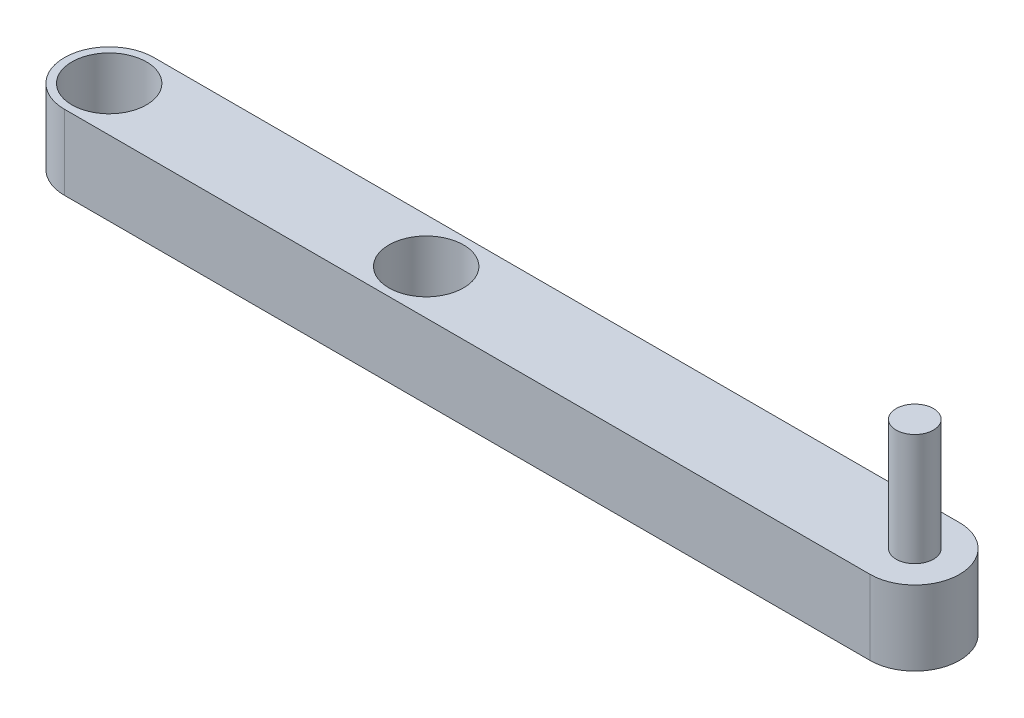
ISO-10303-21;
HEADER;
FILE_DESCRIPTION(('STEP AP214'),'2;1');
FILE_NAME('part.step','',(''),(''),'','','');
FILE_SCHEMA(('AUTOMOTIVE_DESIGN { 1 0 10303 214 1 1 1 1 }'));
ENDSEC;
DATA;
#1=APPLICATION_CONTEXT('core data for automotive mechanical design processes');
#2=APPLICATION_PROTOCOL_DEFINITION('international standard','automotive_design',2000,#1);
#3=PRODUCT_CONTEXT('',#1,'mechanical');
#4=PRODUCT('Part','Part','',(#3));
#5=PRODUCT_RELATED_PRODUCT_CATEGORY('part','',(#4));
#6=PRODUCT_DEFINITION_FORMATION('','',#4);
#7=PRODUCT_DEFINITION_CONTEXT('part definition',#1,'design');
#8=PRODUCT_DEFINITION('design','',#6,#7);
#9=PRODUCT_DEFINITION_SHAPE('','',#8);
#10=(LENGTH_UNIT() NAMED_UNIT(*) SI_UNIT(.MILLI.,.METRE.));
#11=(NAMED_UNIT(*) PLANE_ANGLE_UNIT() SI_UNIT($,.RADIAN.));
#12=(NAMED_UNIT(*) SI_UNIT($,.STERADIAN.) SOLID_ANGLE_UNIT());
#13=UNCERTAINTY_MEASURE_WITH_UNIT(LENGTH_MEASURE(1.E-05),#10,'distance_accuracy_value','');
#14=(GEOMETRIC_REPRESENTATION_CONTEXT(3) GLOBAL_UNCERTAINTY_ASSIGNED_CONTEXT((#13)) GLOBAL_UNIT_ASSIGNED_CONTEXT((#10,
#11,#12)) REPRESENTATION_CONTEXT('',''));
#15=CARTESIAN_POINT('',(0.,0.,0.));
#16=DIRECTION('',(0.,0.,1.));
#17=DIRECTION('',(1.,0.,0.));
#18=AXIS2_PLACEMENT_3D('',#15,#16,#17);
#19=CARTESIAN_POINT('',(0.,10.,0.));
#20=DIRECTION('',(0.,1.,0.));
#21=DIRECTION('',(0.,0.,1.));
#22=AXIS2_PLACEMENT_3D('',#19,#20,#21);
#23=PLANE('',#22);
#24=CARTESIAN_POINT('',(42.5,10.,0.));
#25=DIRECTION('',(0.,1.,0.));
#26=DIRECTION('',(0.,0.,1.));
#27=AXIS2_PLACEMENT_3D('',#24,#25,#26);
#28=CIRCLE('',#27,5.);
#29=CARTESIAN_POINT('',(42.5,10.,5.));
#30=VERTEX_POINT('',#29);
#31=EDGE_CURVE('E116',#30,#30,#28,.T.);
#32=ORIENTED_EDGE('',*,*,#31,.F.);
#33=EDGE_LOOP('',(#32));
#34=FACE_BOUND('',#33,.T.);
#35=CARTESIAN_POINT('',(0.,10.,0.));
#36=DIRECTION('',(0.,1.,0.));
#37=DIRECTION('',(0.,0.,1.));
#38=AXIS2_PLACEMENT_3D('',#35,#36,#37);
#39=CIRCLE('',#38,6.);
#40=CARTESIAN_POINT('',(0.,10.,-6.));
#41=VERTEX_POINT('',#40);
#42=CARTESIAN_POINT('',(0.,10.,6.));
#43=VERTEX_POINT('',#42);
#44=EDGE_CURVE('E86',#41,#43,#39,.T.);
#45=ORIENTED_EDGE('',*,*,#44,.T.);
#46=DIRECTION('',(1.,0.,0.));
#47=VECTOR('',#46,1.);
#48=CARTESIAN_POINT('',(0.,10.,6.));
#49=LINE('',#48,#47);
#50=CARTESIAN_POINT('',(108.,10.,6.));
#51=VERTEX_POINT('',#50);
#52=EDGE_CURVE('E81',#43,#51,#49,.T.);
#53=ORIENTED_EDGE('',*,*,#52,.T.);
#54=CARTESIAN_POINT('',(108.,10.,0.));
#55=DIRECTION('',(0.,1.,0.));
#56=DIRECTION('',(0.,0.,1.));
#57=AXIS2_PLACEMENT_3D('',#54,#55,#56);
#58=CIRCLE('',#57,6.);
#59=CARTESIAN_POINT('',(108.,10.,-6.));
#60=VERTEX_POINT('',#59);
#61=EDGE_CURVE('E84',#51,#60,#58,.T.);
#62=ORIENTED_EDGE('',*,*,#61,.T.);
#63=DIRECTION('',(-1.,0.,0.));
#64=VECTOR('',#63,1.);
#65=CARTESIAN_POINT('',(0.,10.,-6.));
#66=LINE('',#65,#64);
#67=EDGE_CURVE('E51',#60,#41,#66,.T.);
#68=ORIENTED_EDGE('',*,*,#67,.T.);
#69=EDGE_LOOP('',(#45,#53,#62,#68));
#70=FACE_BOUND('',#69,.T.);
#71=CARTESIAN_POINT('',(0.,10.,0.));
#72=DIRECTION('',(0.,1.,0.));
#73=DIRECTION('',(0.,0.,1.));
#74=AXIS2_PLACEMENT_3D('',#71,#72,#73);
#75=CIRCLE('',#74,5.);
#76=CARTESIAN_POINT('',(0.,10.,5.));
#77=VERTEX_POINT('',#76);
#78=EDGE_CURVE('E101',#77,#77,#75,.T.);
#79=ORIENTED_EDGE('',*,*,#78,.F.);
#80=EDGE_LOOP('',(#79));
#81=FACE_BOUND('',#80,.T.);
#82=CARTESIAN_POINT('',(108.,10.,0.));
#83=DIRECTION('',(0.,1.,0.));
#84=DIRECTION('',(0.,0.,1.));
#85=AXIS2_PLACEMENT_3D('',#82,#83,#84);
#86=CIRCLE('',#85,2.5);
#87=CARTESIAN_POINT('',(108.,10.,2.5));
#88=VERTEX_POINT('',#87);
#89=EDGE_CURVE('E125',#88,#88,#86,.T.);
#90=ORIENTED_EDGE('',*,*,#89,.F.);
#91=EDGE_LOOP('',(#90));
#92=FACE_BOUND('',#91,.T.);
#93=ADVANCED_FACE('F34',(#34,#70,#81,#92),#23,.T.);
#94=CARTESIAN_POINT('',(0.,0.,0.));
#95=DIRECTION('',(0.,1.,0.));
#96=DIRECTION('',(0.,0.,1.));
#97=AXIS2_PLACEMENT_3D('',#94,#95,#96);
#98=PLANE('',#97);
#99=CARTESIAN_POINT('',(0.,0.,0.));
#100=DIRECTION('',(0.,1.,0.));
#101=DIRECTION('',(0.,0.,1.));
#102=AXIS2_PLACEMENT_3D('',#99,#100,#101);
#103=CIRCLE('',#102,5.);
#104=CARTESIAN_POINT('',(0.,0.,5.));
#105=VERTEX_POINT('',#104);
#106=EDGE_CURVE('E113',#105,#105,#103,.T.);
#107=ORIENTED_EDGE('',*,*,#106,.T.);
#108=EDGE_LOOP('',(#107));
#109=FACE_BOUND('',#108,.T.);
#110=CARTESIAN_POINT('',(0.,0.,0.));
#111=DIRECTION('',(0.,1.,0.));
#112=DIRECTION('',(0.,0.,1.));
#113=AXIS2_PLACEMENT_3D('',#110,#111,#112);
#114=CIRCLE('',#113,6.);
#115=CARTESIAN_POINT('',(0.,0.,-6.));
#116=VERTEX_POINT('',#115);
#117=CARTESIAN_POINT('',(0.,0.,6.));
#118=VERTEX_POINT('',#117);
#119=EDGE_CURVE('E98',#116,#118,#114,.T.);
#120=ORIENTED_EDGE('',*,*,#119,.F.);
#121=DIRECTION('',(-1.,0.,0.));
#122=VECTOR('',#121,1.);
#123=CARTESIAN_POINT('',(0.,0.,-6.));
#124=LINE('',#123,#122);
#125=CARTESIAN_POINT('',(108.,0.,-6.));
#126=VERTEX_POINT('',#125);
#127=EDGE_CURVE('E74',#126,#116,#124,.T.);
#128=ORIENTED_EDGE('',*,*,#127,.F.);
#129=CARTESIAN_POINT('',(108.,0.,0.));
#130=DIRECTION('',(0.,1.,0.));
#131=DIRECTION('',(0.,0.,1.));
#132=AXIS2_PLACEMENT_3D('',#129,#130,#131);
#133=CIRCLE('',#132,6.);
#134=CARTESIAN_POINT('',(108.,0.,6.));
#135=VERTEX_POINT('',#134);
#136=EDGE_CURVE('E68',#135,#126,#133,.T.);
#137=ORIENTED_EDGE('',*,*,#136,.F.);
#138=DIRECTION('',(1.,0.,0.));
#139=VECTOR('',#138,1.);
#140=CARTESIAN_POINT('',(0.,0.,6.));
#141=LINE('',#140,#139);
#142=EDGE_CURVE('E90',#118,#135,#141,.T.);
#143=ORIENTED_EDGE('',*,*,#142,.F.);
#144=EDGE_LOOP('',(#120,#128,#137,#143));
#145=FACE_BOUND('',#144,.T.);
#146=CARTESIAN_POINT('',(42.5,0.,0.));
#147=DIRECTION('',(0.,1.,0.));
#148=DIRECTION('',(0.,0.,1.));
#149=AXIS2_PLACEMENT_3D('',#146,#147,#148);
#150=CIRCLE('',#149,5.);
#151=CARTESIAN_POINT('',(42.5,0.,5.));
#152=VERTEX_POINT('',#151);
#153=EDGE_CURVE('E119',#152,#152,#150,.T.);
#154=ORIENTED_EDGE('',*,*,#153,.T.);
#155=EDGE_LOOP('',(#154));
#156=FACE_BOUND('',#155,.T.);
#157=ADVANCED_FACE('F109',(#109,#145,#156),#98,.F.);
#158=CARTESIAN_POINT('',(0.,10.,0.));
#159=DIRECTION('',(0.,-1.,0.));
#160=DIRECTION('',(0.,0.,-1.));
#161=AXIS2_PLACEMENT_3D('',#158,#159,#160);
#162=CYLINDRICAL_SURFACE('',#161,6.);
#163=ORIENTED_EDGE('',*,*,#119,.T.);
#164=DIRECTION('',(0.,-1.,0.));
#165=VECTOR('',#164,1.);
#166=CARTESIAN_POINT('',(0.,10.,6.));
#167=LINE('',#166,#165);
#168=EDGE_CURVE('E11',#43,#118,#167,.T.);
#169=ORIENTED_EDGE('',*,*,#168,.F.);
#170=ORIENTED_EDGE('',*,*,#44,.F.);
#171=DIRECTION('',(0.,-1.,0.));
#172=VECTOR('',#171,1.);
#173=CARTESIAN_POINT('',(0.,10.,-6.));
#174=LINE('',#173,#172);
#175=EDGE_CURVE('E94',#41,#116,#174,.T.);
#176=ORIENTED_EDGE('',*,*,#175,.T.);
#177=EDGE_LOOP('',(#163,#169,#170,#176));
#178=FACE_BOUND('',#177,.T.);
#179=ADVANCED_FACE('F36',(#178),#162,.T.);
#180=CARTESIAN_POINT('',(0.,10.,6.));
#181=DIRECTION('',(0.,0.,-1.));
#182=DIRECTION('',(-1.,0.,0.));
#183=AXIS2_PLACEMENT_3D('',#180,#181,#182);
#184=PLANE('',#183);
#185=ORIENTED_EDGE('',*,*,#142,.T.);
#186=DIRECTION('',(0.,-1.,0.));
#187=VECTOR('',#186,1.);
#188=CARTESIAN_POINT('',(108.,10.,6.));
#189=LINE('',#188,#187);
#190=EDGE_CURVE('E43',#51,#135,#189,.T.);
#191=ORIENTED_EDGE('',*,*,#190,.F.);
#192=ORIENTED_EDGE('',*,*,#52,.F.);
#193=ORIENTED_EDGE('',*,*,#168,.T.);
#194=EDGE_LOOP('',(#185,#191,#192,#193));
#195=FACE_BOUND('',#194,.T.);
#196=ADVANCED_FACE('F89',(#195),#184,.F.);
#197=CARTESIAN_POINT('',(108.,10.,0.));
#198=DIRECTION('',(0.,-1.,0.));
#199=DIRECTION('',(0.,0.,-1.));
#200=AXIS2_PLACEMENT_3D('',#197,#198,#199);
#201=CYLINDRICAL_SURFACE('',#200,6.);
#202=ORIENTED_EDGE('',*,*,#136,.T.);
#203=DIRECTION('',(0.,-1.,0.));
#204=VECTOR('',#203,1.);
#205=CARTESIAN_POINT('',(108.,10.,-6.));
#206=LINE('',#205,#204);
#207=EDGE_CURVE('E91',#60,#126,#206,.T.);
#208=ORIENTED_EDGE('',*,*,#207,.F.);
#209=ORIENTED_EDGE('',*,*,#61,.F.);
#210=ORIENTED_EDGE('',*,*,#190,.T.);
#211=EDGE_LOOP('',(#202,#208,#209,#210));
#212=FACE_BOUND('',#211,.T.);
#213=ADVANCED_FACE('F92',(#212),#201,.T.);
#214=CARTESIAN_POINT('',(0.,10.,-6.));
#215=DIRECTION('',(0.,0.,1.));
#216=DIRECTION('',(1.,0.,0.));
#217=AXIS2_PLACEMENT_3D('',#214,#215,#216);
#218=PLANE('',#217);
#219=ORIENTED_EDGE('',*,*,#127,.T.);
#220=ORIENTED_EDGE('',*,*,#175,.F.);
#221=ORIENTED_EDGE('',*,*,#67,.F.);
#222=ORIENTED_EDGE('',*,*,#207,.T.);
#223=EDGE_LOOP('',(#219,#220,#221,#222));
#224=FACE_BOUND('',#223,.T.);
#225=ADVANCED_FACE('F106',(#224),#218,.F.);
#226=CARTESIAN_POINT('',(0.,10.,0.));
#227=DIRECTION('',(0.,-1.,0.));
#228=DIRECTION('',(0.,0.,-1.));
#229=AXIS2_PLACEMENT_3D('',#226,#227,#228);
#230=CYLINDRICAL_SURFACE('',#229,5.);
#231=ORIENTED_EDGE('',*,*,#78,.T.);
#232=EDGE_LOOP('',(#231));
#233=FACE_BOUND('',#232,.T.);
#234=ORIENTED_EDGE('',*,*,#106,.F.);
#235=EDGE_LOOP('',(#234));
#236=FACE_BOUND('',#235,.T.);
#237=ADVANCED_FACE('F150',(#233,#236),#230,.F.);
#238=CARTESIAN_POINT('',(42.5,10.,0.));
#239=DIRECTION('',(0.,-1.,0.));
#240=DIRECTION('',(0.,0.,-1.));
#241=AXIS2_PLACEMENT_3D('',#238,#239,#240);
#242=CYLINDRICAL_SURFACE('',#241,5.);
#243=ORIENTED_EDGE('',*,*,#31,.T.);
#244=EDGE_LOOP('',(#243));
#245=FACE_BOUND('',#244,.T.);
#246=ORIENTED_EDGE('',*,*,#153,.F.);
#247=EDGE_LOOP('',(#246));
#248=FACE_BOUND('',#247,.T.);
#249=ADVANCED_FACE('F136',(#245,#248),#242,.F.);
#250=CARTESIAN_POINT('',(108.,25.,0.));
#251=DIRECTION('',(0.,-1.,0.));
#252=DIRECTION('',(0.,0.,-1.));
#253=AXIS2_PLACEMENT_3D('',#250,#251,#252);
#254=CYLINDRICAL_SURFACE('',#253,2.5);
#255=CARTESIAN_POINT('',(108.,25.,0.));
#256=DIRECTION('',(0.,1.,0.));
#257=DIRECTION('',(0.,0.,1.));
#258=AXIS2_PLACEMENT_3D('',#255,#256,#257);
#259=CIRCLE('',#258,2.5);
#260=CARTESIAN_POINT('',(108.,25.,2.5));
#261=VERTEX_POINT('',#260);
#262=EDGE_CURVE('E122',#261,#261,#259,.T.);
#263=ORIENTED_EDGE('',*,*,#262,.F.);
#264=EDGE_LOOP('',(#263));
#265=FACE_BOUND('',#264,.T.);
#266=ORIENTED_EDGE('',*,*,#89,.T.);
#267=EDGE_LOOP('',(#266));
#268=FACE_BOUND('',#267,.T.);
#269=ADVANCED_FACE('F133',(#265,#268),#254,.T.);
#270=CARTESIAN_POINT('',(108.,25.,0.));
#271=DIRECTION('',(0.,1.,0.));
#272=DIRECTION('',(0.,0.,1.));
#273=AXIS2_PLACEMENT_3D('',#270,#271,#272);
#274=PLANE('',#273);
#275=ORIENTED_EDGE('',*,*,#262,.T.);
#276=EDGE_LOOP('',(#275));
#277=FACE_BOUND('',#276,.T.);
#278=ADVANCED_FACE('F131',(#277),#274,.T.);
#279=CLOSED_SHELL('',(#93,#157,#179,#196,#213,#225,#237,#249,#269,#278));
#280=MANIFOLD_SOLID_BREP('B2',#279);
#281=ADVANCED_BREP_SHAPE_REPRESENTATION('',(#18,#280),#14);
#282=SHAPE_DEFINITION_REPRESENTATION(#9,#281);
ENDSEC;
END-ISO-10303-21;
